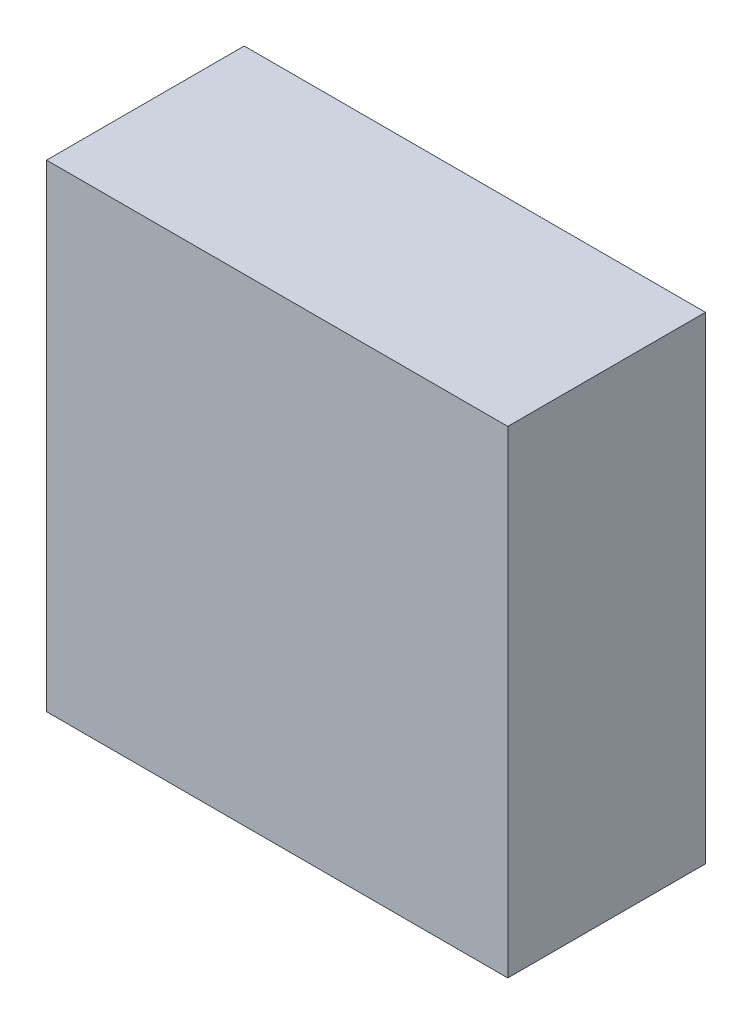
ISO-10303-21;
HEADER;
FILE_DESCRIPTION(('STEP AP214'),'2;1');
FILE_NAME('part.step','',(''),(''),'','','');
FILE_SCHEMA(('AUTOMOTIVE_DESIGN { 1 0 10303 214 1 1 1 1 }'));
ENDSEC;
DATA;
#1=APPLICATION_CONTEXT('core data for automotive mechanical design processes');
#2=APPLICATION_PROTOCOL_DEFINITION('international standard','automotive_design',2000,#1);
#3=PRODUCT_CONTEXT('',#1,'mechanical');
#4=PRODUCT('Part','Part','',(#3));
#5=PRODUCT_RELATED_PRODUCT_CATEGORY('part','',(#4));
#6=PRODUCT_DEFINITION_FORMATION('','',#4);
#7=PRODUCT_DEFINITION_CONTEXT('part definition',#1,'design');
#8=PRODUCT_DEFINITION('design','',#6,#7);
#9=PRODUCT_DEFINITION_SHAPE('','',#8);
#10=(LENGTH_UNIT() NAMED_UNIT(*) SI_UNIT(.MILLI.,.METRE.));
#11=(NAMED_UNIT(*) PLANE_ANGLE_UNIT() SI_UNIT($,.RADIAN.));
#12=(NAMED_UNIT(*) SI_UNIT($,.STERADIAN.) SOLID_ANGLE_UNIT());
#13=UNCERTAINTY_MEASURE_WITH_UNIT(LENGTH_MEASURE(1.E-05),#10,'distance_accuracy_value','');
#14=(GEOMETRIC_REPRESENTATION_CONTEXT(3) GLOBAL_UNCERTAINTY_ASSIGNED_CONTEXT((#13)) GLOBAL_UNIT_ASSIGNED_CONTEXT((#10,
#11,#12)) REPRESENTATION_CONTEXT('',''));
#15=CARTESIAN_POINT('',(0.,0.,0.));
#16=DIRECTION('',(0.,0.,1.));
#17=DIRECTION('',(1.,0.,0.));
#18=AXIS2_PLACEMENT_3D('',#15,#16,#17);
#19=CARTESIAN_POINT('',(-0.699981689453125,0.725006103515625,0.));
#20=DIRECTION('',(-1.,0.,0.));
#21=DIRECTION('',(0.,-1.,0.));
#22=AXIS2_PLACEMENT_3D('',#19,#20,#21);
#23=PLANE('',#22);
#24=DIRECTION('',(0.,-1.,0.));
#25=VECTOR('',#24,1.);
#26=CARTESIAN_POINT('',(-0.699981689453125,0.725006103515625,0.));
#27=LINE('',#26,#25);
#28=CARTESIAN_POINT('',(-0.699981689453125,0.725006103515625,0.));
#29=VERTEX_POINT('',#28);
#30=CARTESIAN_POINT('',(-0.699981689453125,-0.724998474121094,0.));
#31=VERTEX_POINT('',#30);
#32=EDGE_CURVE('E11',#29,#31,#27,.T.);
#33=ORIENTED_EDGE('',*,*,#32,.T.);
#34=DIRECTION('',(0.,0.,1.));
#35=VECTOR('',#34,1.);
#36=CARTESIAN_POINT('',(-0.699981689453125,-0.724998474121094,0.));
#37=LINE('',#36,#35);
#38=CARTESIAN_POINT('',(-0.699981689453125,-0.724998474121094,0.599998772144318));
#39=VERTEX_POINT('',#38);
#40=EDGE_CURVE('E88',#31,#39,#37,.T.);
#41=ORIENTED_EDGE('',*,*,#40,.T.);
#42=DIRECTION('',(0.,-1.,0.));
#43=VECTOR('',#42,1.);
#44=CARTESIAN_POINT('',(-0.699981689453125,0.725006103515625,0.599998772144318));
#45=LINE('',#44,#43);
#46=CARTESIAN_POINT('',(-0.699981689453125,0.725006103515625,0.599998772144318));
#47=VERTEX_POINT('',#46);
#48=EDGE_CURVE('E83',#47,#39,#45,.T.);
#49=ORIENTED_EDGE('',*,*,#48,.F.);
#50=DIRECTION('',(0.,0.,1.));
#51=VECTOR('',#50,1.);
#52=CARTESIAN_POINT('',(-0.699981689453125,0.725006103515625,0.));
#53=LINE('',#52,#51);
#54=EDGE_CURVE('E72',#29,#47,#53,.T.);
#55=ORIENTED_EDGE('',*,*,#54,.F.);
#56=EDGE_LOOP('',(#33,#41,#49,#55));
#57=FACE_BOUND('',#56,.T.);
#58=ADVANCED_FACE('F17',(#57),#23,.T.);
#59=CARTESIAN_POINT('',(-0.699981689453125,-0.724998474121094,0.));
#60=DIRECTION('',(0.,-1.,0.));
#61=DIRECTION('',(1.,0.,0.));
#62=AXIS2_PLACEMENT_3D('',#59,#60,#61);
#63=PLANE('',#62);
#64=DIRECTION('',(1.,0.,0.));
#65=VECTOR('',#64,1.);
#66=CARTESIAN_POINT('',(-0.699981689453125,-0.724998474121094,0.));
#67=LINE('',#66,#65);
#68=CARTESIAN_POINT('',(0.699981689453125,-0.724998474121094,0.));
#69=VERTEX_POINT('',#68);
#70=EDGE_CURVE('E24',#31,#69,#67,.T.);
#71=ORIENTED_EDGE('',*,*,#70,.T.);
#72=DIRECTION('',(0.,0.,1.));
#73=VECTOR('',#72,1.);
#74=CARTESIAN_POINT('',(0.699981689453125,-0.724998474121094,0.));
#75=LINE('',#74,#73);
#76=CARTESIAN_POINT('',(0.699981689453125,-0.724998474121094,0.599998772144318));
#77=VERTEX_POINT('',#76);
#78=EDGE_CURVE('E85',#69,#77,#75,.T.);
#79=ORIENTED_EDGE('',*,*,#78,.T.);
#80=DIRECTION('',(1.,0.,0.));
#81=VECTOR('',#80,1.);
#82=CARTESIAN_POINT('',(-0.699981689453125,-0.724998474121094,0.599998772144318));
#83=LINE('',#82,#81);
#84=EDGE_CURVE('E66',#39,#77,#83,.T.);
#85=ORIENTED_EDGE('',*,*,#84,.F.);
#86=ORIENTED_EDGE('',*,*,#40,.F.);
#87=EDGE_LOOP('',(#71,#79,#85,#86));
#88=FACE_BOUND('',#87,.T.);
#89=ADVANCED_FACE('F89',(#88),#63,.T.);
#90=CARTESIAN_POINT('',(0.699981689453125,-0.724998474121094,0.));
#91=DIRECTION('',(1.,0.,0.));
#92=DIRECTION('',(0.,1.,0.));
#93=AXIS2_PLACEMENT_3D('',#90,#91,#92);
#94=PLANE('',#93);
#95=DIRECTION('',(0.,1.,0.));
#96=VECTOR('',#95,1.);
#97=CARTESIAN_POINT('',(0.699981689453125,-0.724998474121094,0.));
#98=LINE('',#97,#96);
#99=CARTESIAN_POINT('',(0.699981689453125,0.725006103515625,0.));
#100=VERTEX_POINT('',#99);
#101=EDGE_CURVE('E62',#69,#100,#98,.T.);
#102=ORIENTED_EDGE('',*,*,#101,.T.);
#103=DIRECTION('',(0.,0.,1.));
#104=VECTOR('',#103,1.);
#105=CARTESIAN_POINT('',(0.699981689453125,0.725006103515625,0.));
#106=LINE('',#105,#104);
#107=CARTESIAN_POINT('',(0.699981689453125,0.725006103515625,0.599998772144318));
#108=VERTEX_POINT('',#107);
#109=EDGE_CURVE('E55',#100,#108,#106,.T.);
#110=ORIENTED_EDGE('',*,*,#109,.T.);
#111=DIRECTION('',(0.,1.,0.));
#112=VECTOR('',#111,1.);
#113=CARTESIAN_POINT('',(0.699981689453125,-0.724998474121094,0.599998772144318));
#114=LINE('',#113,#112);
#115=EDGE_CURVE('E59',#77,#108,#114,.T.);
#116=ORIENTED_EDGE('',*,*,#115,.F.);
#117=ORIENTED_EDGE('',*,*,#78,.F.);
#118=EDGE_LOOP('',(#102,#110,#116,#117));
#119=FACE_BOUND('',#118,.T.);
#120=ADVANCED_FACE('F57',(#119),#94,.T.);
#121=CARTESIAN_POINT('',(0.699981689453125,0.725006103515625,0.));
#122=DIRECTION('',(0.,1.,0.));
#123=DIRECTION('',(-1.,0.,0.));
#124=AXIS2_PLACEMENT_3D('',#121,#122,#123);
#125=PLANE('',#124);
#126=DIRECTION('',(-1.,0.,0.));
#127=VECTOR('',#126,1.);
#128=CARTESIAN_POINT('',(0.699981689453125,0.725006103515625,0.));
#129=LINE('',#128,#127);
#130=EDGE_CURVE('E65',#100,#29,#129,.T.);
#131=ORIENTED_EDGE('',*,*,#130,.T.);
#132=ORIENTED_EDGE('',*,*,#54,.T.);
#133=DIRECTION('',(-1.,0.,0.));
#134=VECTOR('',#133,1.);
#135=CARTESIAN_POINT('',(0.699981689453125,0.725006103515625,0.599998772144318));
#136=LINE('',#135,#134);
#137=EDGE_CURVE('E70',#108,#47,#136,.T.);
#138=ORIENTED_EDGE('',*,*,#137,.F.);
#139=ORIENTED_EDGE('',*,*,#109,.F.);
#140=EDGE_LOOP('',(#131,#132,#138,#139));
#141=FACE_BOUND('',#140,.T.);
#142=ADVANCED_FACE('F71',(#141),#125,.T.);
#143=CARTESIAN_POINT('',(-489.75,-105.025001525879,0.599998772144318));
#144=DIRECTION('',(0.,0.,1.));
#145=DIRECTION('',(1.,0.,0.));
#146=AXIS2_PLACEMENT_3D('',#143,#144,#145);
#147=PLANE('',#146);
#148=ORIENTED_EDGE('',*,*,#48,.T.);
#149=ORIENTED_EDGE('',*,*,#84,.T.);
#150=ORIENTED_EDGE('',*,*,#115,.T.);
#151=ORIENTED_EDGE('',*,*,#137,.T.);
#152=EDGE_LOOP('',(#148,#149,#150,#151));
#153=FACE_BOUND('',#152,.T.);
#154=ADVANCED_FACE('F76',(#153),#147,.T.);
#155=CARTESIAN_POINT('',(-489.75,-105.025001525879,0.));
#156=DIRECTION('',(0.,0.,1.));
#157=DIRECTION('',(1.,0.,0.));
#158=AXIS2_PLACEMENT_3D('',#155,#156,#157);
#159=PLANE('',#158);
#160=ORIENTED_EDGE('',*,*,#130,.F.);
#161=ORIENTED_EDGE('',*,*,#101,.F.);
#162=ORIENTED_EDGE('',*,*,#70,.F.);
#163=ORIENTED_EDGE('',*,*,#32,.F.);
#164=EDGE_LOOP('',(#160,#161,#162,#163));
#165=FACE_BOUND('',#164,.T.);
#166=ADVANCED_FACE('F91',(#165),#159,.F.);
#167=CLOSED_SHELL('',(#58,#89,#120,#142,#154,#166));
#168=MANIFOLD_SOLID_BREP('B1',#167);
#169=ADVANCED_BREP_SHAPE_REPRESENTATION('',(#18,#168),#14);
#170=SHAPE_DEFINITION_REPRESENTATION(#9,#169);
ENDSEC;
END-ISO-10303-21;
